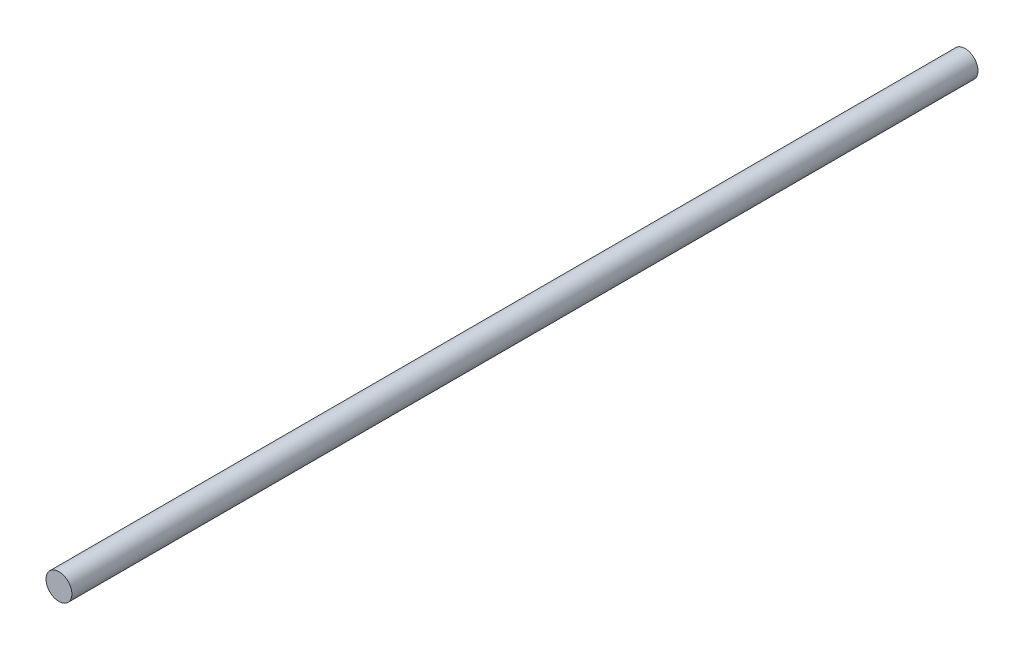
ISO-10303-21;
HEADER;
FILE_DESCRIPTION(('STEP AP214'),'2;1');
FILE_NAME('part.step','',(''),(''),'','','');
FILE_SCHEMA(('AUTOMOTIVE_DESIGN { 1 0 10303 214 1 1 1 1 }'));
ENDSEC;
DATA;
#1=APPLICATION_CONTEXT('core data for automotive mechanical design processes');
#2=APPLICATION_PROTOCOL_DEFINITION('international standard','automotive_design',2000,#1);
#3=PRODUCT_CONTEXT('',#1,'mechanical');
#4=PRODUCT('Part','Part','',(#3));
#5=PRODUCT_RELATED_PRODUCT_CATEGORY('part','',(#4));
#6=PRODUCT_DEFINITION_FORMATION('','',#4);
#7=PRODUCT_DEFINITION_CONTEXT('part definition',#1,'design');
#8=PRODUCT_DEFINITION('design','',#6,#7);
#9=PRODUCT_DEFINITION_SHAPE('','',#8);
#10=(LENGTH_UNIT() NAMED_UNIT(*) SI_UNIT(.MILLI.,.METRE.));
#11=(NAMED_UNIT(*) PLANE_ANGLE_UNIT() SI_UNIT($,.RADIAN.));
#12=(NAMED_UNIT(*) SI_UNIT($,.STERADIAN.) SOLID_ANGLE_UNIT());
#13=UNCERTAINTY_MEASURE_WITH_UNIT(LENGTH_MEASURE(1.E-05),#10,'distance_accuracy_value','');
#14=(GEOMETRIC_REPRESENTATION_CONTEXT(3) GLOBAL_UNCERTAINTY_ASSIGNED_CONTEXT((#13)) GLOBAL_UNIT_ASSIGNED_CONTEXT((#10,
#11,#12)) REPRESENTATION_CONTEXT('',''));
#15=CARTESIAN_POINT('',(0.,0.,0.));
#16=DIRECTION('',(0.,0.,1.));
#17=DIRECTION('',(1.,0.,0.));
#18=AXIS2_PLACEMENT_3D('',#15,#16,#17);
#19=CARTESIAN_POINT('',(0.,0.,444.5));
#20=DIRECTION('',(0.,0.,-1.));
#21=DIRECTION('',(-1.,0.,0.));
#22=AXIS2_PLACEMENT_3D('',#19,#20,#21);
#23=CYLINDRICAL_SURFACE('',#22,6.35);
#24=CARTESIAN_POINT('',(0.,0.,444.5));
#25=DIRECTION('',(0.,0.,1.));
#26=DIRECTION('',(1.,0.,0.));
#27=AXIS2_PLACEMENT_3D('',#24,#25,#26);
#28=CIRCLE('',#27,6.35);
#29=CARTESIAN_POINT('',(6.35,0.,444.5));
#30=VERTEX_POINT('',#29);
#31=EDGE_CURVE('E10',#30,#30,#28,.T.);
#32=ORIENTED_EDGE('',*,*,#31,.F.);
#33=EDGE_LOOP('',(#32));
#34=FACE_BOUND('',#33,.T.);
#35=CARTESIAN_POINT('',(0.,0.,0.));
#36=DIRECTION('',(0.,0.,1.));
#37=DIRECTION('',(1.,0.,0.));
#38=AXIS2_PLACEMENT_3D('',#35,#36,#37);
#39=CIRCLE('',#38,6.35);
#40=CARTESIAN_POINT('',(6.35,0.,0.));
#41=VERTEX_POINT('',#40);
#42=EDGE_CURVE('E40',#41,#41,#39,.T.);
#43=ORIENTED_EDGE('',*,*,#42,.T.);
#44=EDGE_LOOP('',(#43));
#45=FACE_BOUND('',#44,.T.);
#46=ADVANCED_FACE('F37',(#34,#45),#23,.T.);
#47=CARTESIAN_POINT('',(0.,0.,444.5));
#48=DIRECTION('',(0.,0.,1.));
#49=DIRECTION('',(1.,0.,0.));
#50=AXIS2_PLACEMENT_3D('',#47,#48,#49);
#51=PLANE('',#50);
#52=ORIENTED_EDGE('',*,*,#31,.T.);
#53=EDGE_LOOP('',(#52));
#54=FACE_BOUND('',#53,.T.);
#55=ADVANCED_FACE('F52',(#54),#51,.T.);
#56=CARTESIAN_POINT('',(0.,0.,0.));
#57=DIRECTION('',(0.,0.,1.));
#58=DIRECTION('',(1.,0.,0.));
#59=AXIS2_PLACEMENT_3D('',#56,#57,#58);
#60=PLANE('',#59);
#61=ORIENTED_EDGE('',*,*,#42,.F.);
#62=EDGE_LOOP('',(#61));
#63=FACE_BOUND('',#62,.T.);
#64=ADVANCED_FACE('F50',(#63),#60,.F.);
#65=CLOSED_SHELL('',(#46,#55,#64));
#66=MANIFOLD_SOLID_BREP('B2',#65);
#67=ADVANCED_BREP_SHAPE_REPRESENTATION('',(#18,#66),#14);
#68=SHAPE_DEFINITION_REPRESENTATION(#9,#67);
ENDSEC;
END-ISO-10303-21;
